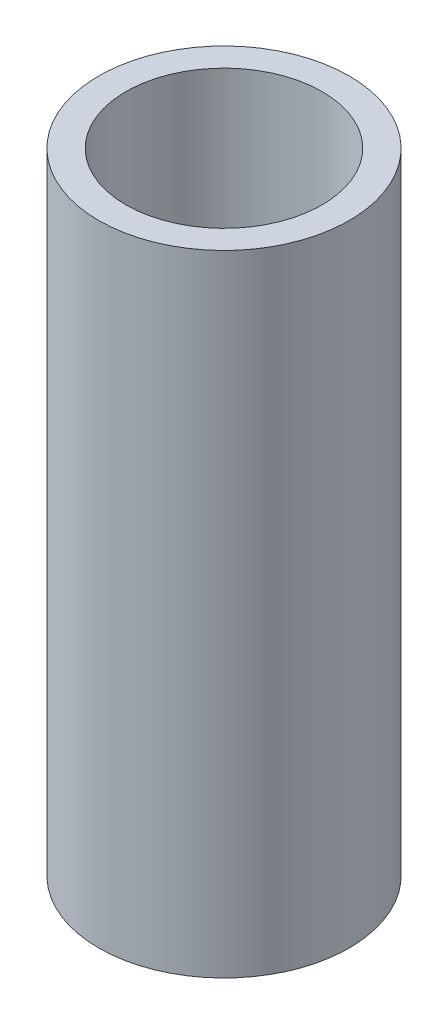
ISO-10303-21;
HEADER;
FILE_DESCRIPTION(('STEP AP214'),'2;1');
FILE_NAME('part.step','',(''),(''),'','','');
FILE_SCHEMA(('AUTOMOTIVE_DESIGN { 1 0 10303 214 1 1 1 1 }'));
ENDSEC;
DATA;
#1=APPLICATION_CONTEXT('core data for automotive mechanical design processes');
#2=APPLICATION_PROTOCOL_DEFINITION('international standard','automotive_design',2000,#1);
#3=PRODUCT_CONTEXT('',#1,'mechanical');
#4=PRODUCT('Part','Part','',(#3));
#5=PRODUCT_RELATED_PRODUCT_CATEGORY('part','',(#4));
#6=PRODUCT_DEFINITION_FORMATION('','',#4);
#7=PRODUCT_DEFINITION_CONTEXT('part definition',#1,'design');
#8=PRODUCT_DEFINITION('design','',#6,#7);
#9=PRODUCT_DEFINITION_SHAPE('','',#8);
#10=(LENGTH_UNIT() NAMED_UNIT(*) SI_UNIT(.MILLI.,.METRE.));
#11=(NAMED_UNIT(*) PLANE_ANGLE_UNIT() SI_UNIT($,.RADIAN.));
#12=(NAMED_UNIT(*) SI_UNIT($,.STERADIAN.) SOLID_ANGLE_UNIT());
#13=UNCERTAINTY_MEASURE_WITH_UNIT(LENGTH_MEASURE(1.E-05),#10,'distance_accuracy_value','');
#14=(GEOMETRIC_REPRESENTATION_CONTEXT(3) GLOBAL_UNCERTAINTY_ASSIGNED_CONTEXT((#13)) GLOBAL_UNIT_ASSIGNED_CONTEXT((#10,
#11,#12)) REPRESENTATION_CONTEXT('',''));
#15=CARTESIAN_POINT('',(0.,0.,0.));
#16=DIRECTION('',(0.,0.,1.));
#17=DIRECTION('',(1.,0.,0.));
#18=AXIS2_PLACEMENT_3D('',#15,#16,#17);
#19=CARTESIAN_POINT('',(0.,113.200741779798,0.));
#20=DIRECTION('',(0.,-1.,0.));
#21=DIRECTION('',(0.,0.,-1.));
#22=AXIS2_PLACEMENT_3D('',#19,#20,#21);
#23=CYLINDRICAL_SURFACE('',#22,22.5);
#24=CARTESIAN_POINT('',(0.,113.200741779798,0.));
#25=DIRECTION('',(0.,1.,0.));
#26=DIRECTION('',(0.,0.,1.));
#27=AXIS2_PLACEMENT_3D('',#24,#25,#26);
#28=CIRCLE('',#27,22.5);
#29=CARTESIAN_POINT('',(0.,113.200741779798,22.5));
#30=VERTEX_POINT('',#29);
#31=EDGE_CURVE('E10',#30,#30,#28,.T.);
#32=ORIENTED_EDGE('',*,*,#31,.F.);
#33=EDGE_LOOP('',(#32));
#34=FACE_BOUND('',#33,.T.);
#35=CARTESIAN_POINT('',(0.,0.,0.));
#36=DIRECTION('',(0.,1.,0.));
#37=DIRECTION('',(0.,0.,1.));
#38=AXIS2_PLACEMENT_3D('',#35,#36,#37);
#39=CIRCLE('',#38,22.5);
#40=CARTESIAN_POINT('',(0.,0.,22.5));
#41=VERTEX_POINT('',#40);
#42=EDGE_CURVE('E37',#41,#41,#39,.T.);
#43=ORIENTED_EDGE('',*,*,#42,.T.);
#44=EDGE_LOOP('',(#43));
#45=FACE_BOUND('',#44,.T.);
#46=ADVANCED_FACE('F40',(#34,#45),#23,.T.);
#47=CARTESIAN_POINT('',(0.,113.200741779798,0.));
#48=DIRECTION('',(0.,1.,0.));
#49=DIRECTION('',(0.,0.,1.));
#50=AXIS2_PLACEMENT_3D('',#47,#48,#49);
#51=PLANE('',#50);
#52=CARTESIAN_POINT('',(0.,113.200741779798,0.));
#53=DIRECTION('',(0.,1.,0.));
#54=DIRECTION('',(0.,0.,1.));
#55=AXIS2_PLACEMENT_3D('',#52,#53,#54);
#56=CIRCLE('',#55,17.6315081692381);
#57=CARTESIAN_POINT('',(0.,113.200741779798,17.6315081692381));
#58=VERTEX_POINT('',#57);
#59=EDGE_CURVE('E50',#58,#58,#56,.T.);
#60=ORIENTED_EDGE('',*,*,#59,.F.);
#61=EDGE_LOOP('',(#60));
#62=FACE_BOUND('',#61,.T.);
#63=ORIENTED_EDGE('',*,*,#31,.T.);
#64=EDGE_LOOP('',(#63));
#65=FACE_BOUND('',#64,.T.);
#66=ADVANCED_FACE('F59',(#62,#65),#51,.T.);
#67=CARTESIAN_POINT('',(0.,0.,0.));
#68=DIRECTION('',(0.,1.,0.));
#69=DIRECTION('',(0.,0.,1.));
#70=AXIS2_PLACEMENT_3D('',#67,#68,#69);
#71=PLANE('',#70);
#72=CARTESIAN_POINT('',(0.,0.,0.));
#73=DIRECTION('',(0.,1.,0.));
#74=DIRECTION('',(0.,0.,1.));
#75=AXIS2_PLACEMENT_3D('',#72,#73,#74);
#76=CIRCLE('',#75,17.6315081692381);
#77=CARTESIAN_POINT('',(0.,0.,17.6315081692381));
#78=VERTEX_POINT('',#77);
#79=EDGE_CURVE('E47',#78,#78,#76,.T.);
#80=ORIENTED_EDGE('',*,*,#79,.T.);
#81=EDGE_LOOP('',(#80));
#82=FACE_BOUND('',#81,.T.);
#83=ORIENTED_EDGE('',*,*,#42,.F.);
#84=EDGE_LOOP('',(#83));
#85=FACE_BOUND('',#84,.T.);
#86=ADVANCED_FACE('F58',(#82,#85),#71,.F.);
#87=CARTESIAN_POINT('',(0.,113.200741779798,0.));
#88=DIRECTION('',(0.,-1.,0.));
#89=DIRECTION('',(0.,0.,-1.));
#90=AXIS2_PLACEMENT_3D('',#87,#88,#89);
#91=CYLINDRICAL_SURFACE('',#90,17.6315081692381);
#92=ORIENTED_EDGE('',*,*,#59,.T.);
#93=EDGE_LOOP('',(#92));
#94=FACE_BOUND('',#93,.T.);
#95=ORIENTED_EDGE('',*,*,#79,.F.);
#96=EDGE_LOOP('',(#95));
#97=FACE_BOUND('',#96,.T.);
#98=ADVANCED_FACE('F54',(#94,#97),#91,.F.);
#99=CLOSED_SHELL('',(#46,#66,#86,#98));
#100=MANIFOLD_SOLID_BREP('B2',#99);
#101=ADVANCED_BREP_SHAPE_REPRESENTATION('',(#18,#100),#14);
#102=SHAPE_DEFINITION_REPRESENTATION(#9,#101);
ENDSEC;
END-ISO-10303-21;
